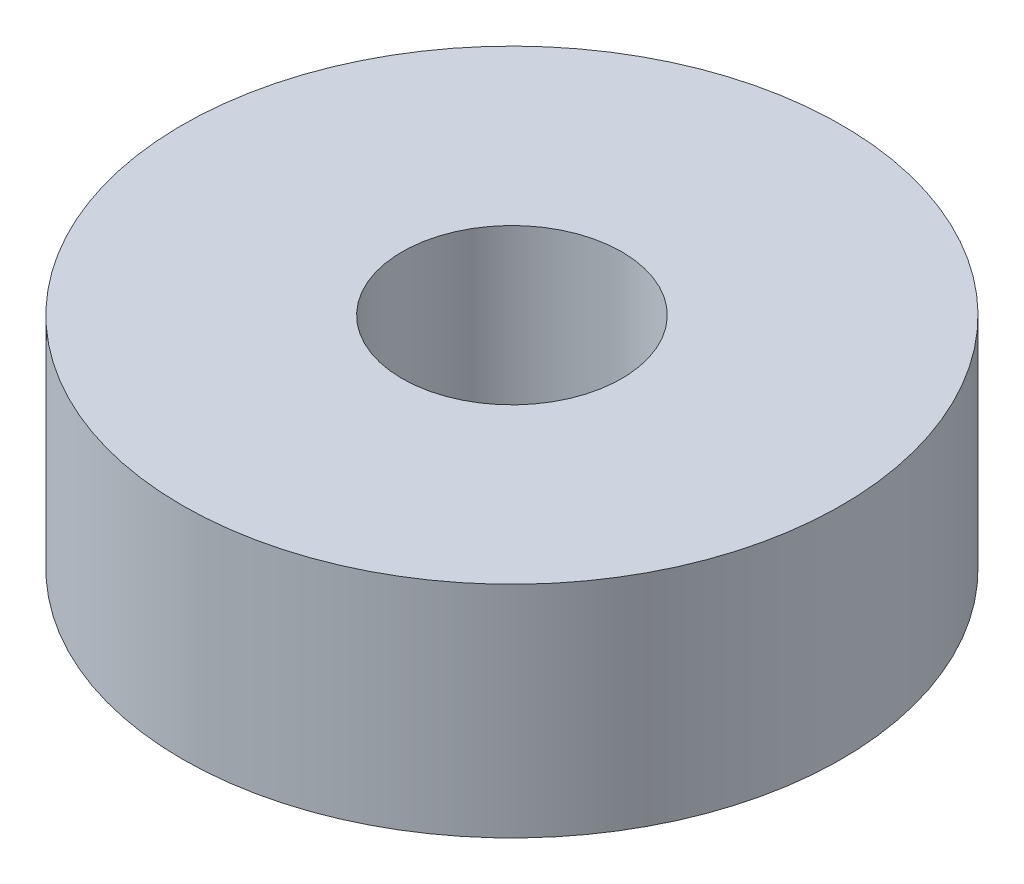
ISO-10303-21;
HEADER;
FILE_DESCRIPTION(('STEP AP214'),'2;1');
FILE_NAME('part.step','',(''),(''),'','','');
FILE_SCHEMA(('AUTOMOTIVE_DESIGN { 1 0 10303 214 1 1 1 1 }'));
ENDSEC;
DATA;
#1=APPLICATION_CONTEXT('core data for automotive mechanical design processes');
#2=APPLICATION_PROTOCOL_DEFINITION('international standard','automotive_design',2000,#1);
#3=PRODUCT_CONTEXT('',#1,'mechanical');
#4=PRODUCT('Part','Part','',(#3));
#5=PRODUCT_RELATED_PRODUCT_CATEGORY('part','',(#4));
#6=PRODUCT_DEFINITION_FORMATION('','',#4);
#7=PRODUCT_DEFINITION_CONTEXT('part definition',#1,'design');
#8=PRODUCT_DEFINITION('design','',#6,#7);
#9=PRODUCT_DEFINITION_SHAPE('','',#8);
#10=(LENGTH_UNIT() NAMED_UNIT(*) SI_UNIT(.MILLI.,.METRE.));
#11=(NAMED_UNIT(*) PLANE_ANGLE_UNIT() SI_UNIT($,.RADIAN.));
#12=(NAMED_UNIT(*) SI_UNIT($,.STERADIAN.) SOLID_ANGLE_UNIT());
#13=UNCERTAINTY_MEASURE_WITH_UNIT(LENGTH_MEASURE(1.E-05),#10,'distance_accuracy_value','');
#14=(GEOMETRIC_REPRESENTATION_CONTEXT(3) GLOBAL_UNCERTAINTY_ASSIGNED_CONTEXT((#13)) GLOBAL_UNIT_ASSIGNED_CONTEXT((#10,
#11,#12)) REPRESENTATION_CONTEXT('',''));
#15=CARTESIAN_POINT('',(0.,0.,0.));
#16=DIRECTION('',(0.,0.,1.));
#17=DIRECTION('',(1.,0.,0.));
#18=AXIS2_PLACEMENT_3D('',#15,#16,#17);
#19=CARTESIAN_POINT('',(0.,3.,0.));
#20=DIRECTION('',(0.,1.,0.));
#21=DIRECTION('',(0.,0.,1.));
#22=AXIS2_PLACEMENT_3D('',#19,#20,#21);
#23=PLANE('',#22);
#24=CARTESIAN_POINT('',(0.,3.,0.));
#25=DIRECTION('',(0.,1.,0.));
#26=DIRECTION('',(0.,0.,1.));
#27=AXIS2_PLACEMENT_3D('',#24,#25,#26);
#28=CIRCLE('',#27,4.5);
#29=CARTESIAN_POINT('',(0.,3.,4.5));
#30=VERTEX_POINT('',#29);
#31=EDGE_CURVE('E10',#30,#30,#28,.T.);
#32=ORIENTED_EDGE('',*,*,#31,.T.);
#33=EDGE_LOOP('',(#32));
#34=FACE_BOUND('',#33,.T.);
#35=CARTESIAN_POINT('',(0.,3.,0.));
#36=DIRECTION('',(0.,1.,0.));
#37=DIRECTION('',(0.,0.,1.));
#38=AXIS2_PLACEMENT_3D('',#35,#36,#37);
#39=CIRCLE('',#38,1.5);
#40=CARTESIAN_POINT('',(0.,3.,1.5));
#41=VERTEX_POINT('',#40);
#42=EDGE_CURVE('E43',#41,#41,#39,.T.);
#43=ORIENTED_EDGE('',*,*,#42,.F.);
#44=EDGE_LOOP('',(#43));
#45=FACE_BOUND('',#44,.T.);
#46=ADVANCED_FACE('F32',(#34,#45),#23,.T.);
#47=CARTESIAN_POINT('',(0.,0.,0.));
#48=DIRECTION('',(0.,1.,0.));
#49=DIRECTION('',(0.,0.,1.));
#50=AXIS2_PLACEMENT_3D('',#47,#48,#49);
#51=PLANE('',#50);
#52=CARTESIAN_POINT('',(0.,0.,0.));
#53=DIRECTION('',(0.,1.,0.));
#54=DIRECTION('',(0.,0.,1.));
#55=AXIS2_PLACEMENT_3D('',#52,#53,#54);
#56=CIRCLE('',#55,4.5);
#57=CARTESIAN_POINT('',(0.,0.,4.5));
#58=VERTEX_POINT('',#57);
#59=EDGE_CURVE('E36',#58,#58,#56,.T.);
#60=ORIENTED_EDGE('',*,*,#59,.F.);
#61=EDGE_LOOP('',(#60));
#62=FACE_BOUND('',#61,.T.);
#63=CARTESIAN_POINT('',(0.,0.,0.));
#64=DIRECTION('',(0.,1.,0.));
#65=DIRECTION('',(0.,0.,1.));
#66=AXIS2_PLACEMENT_3D('',#63,#64,#65);
#67=CIRCLE('',#66,1.5);
#68=CARTESIAN_POINT('',(0.,0.,1.5));
#69=VERTEX_POINT('',#68);
#70=EDGE_CURVE('E45',#69,#69,#67,.T.);
#71=ORIENTED_EDGE('',*,*,#70,.T.);
#72=EDGE_LOOP('',(#71));
#73=FACE_BOUND('',#72,.T.);
#74=ADVANCED_FACE('F55',(#62,#73),#51,.F.);
#75=CARTESIAN_POINT('',(0.,3.,0.));
#76=DIRECTION('',(0.,-1.,0.));
#77=DIRECTION('',(0.,0.,-1.));
#78=AXIS2_PLACEMENT_3D('',#75,#76,#77);
#79=CYLINDRICAL_SURFACE('',#78,4.5);
#80=ORIENTED_EDGE('',*,*,#31,.F.);
#81=EDGE_LOOP('',(#80));
#82=FACE_BOUND('',#81,.T.);
#83=ORIENTED_EDGE('',*,*,#59,.T.);
#84=EDGE_LOOP('',(#83));
#85=FACE_BOUND('',#84,.T.);
#86=ADVANCED_FACE('F34',(#82,#85),#79,.T.);
#87=CARTESIAN_POINT('',(0.,3.,0.));
#88=DIRECTION('',(0.,-1.,0.));
#89=DIRECTION('',(0.,0.,-1.));
#90=AXIS2_PLACEMENT_3D('',#87,#88,#89);
#91=CYLINDRICAL_SURFACE('',#90,1.5);
#92=ORIENTED_EDGE('',*,*,#42,.T.);
#93=EDGE_LOOP('',(#92));
#94=FACE_BOUND('',#93,.T.);
#95=ORIENTED_EDGE('',*,*,#70,.F.);
#96=EDGE_LOOP('',(#95));
#97=FACE_BOUND('',#96,.T.);
#98=ADVANCED_FACE('F51',(#94,#97),#91,.F.);
#99=CLOSED_SHELL('',(#46,#74,#86,#98));
#100=MANIFOLD_SOLID_BREP('B2',#99);
#101=ADVANCED_BREP_SHAPE_REPRESENTATION('',(#18,#100),#14);
#102=SHAPE_DEFINITION_REPRESENTATION(#9,#101);
ENDSEC;
END-ISO-10303-21;
